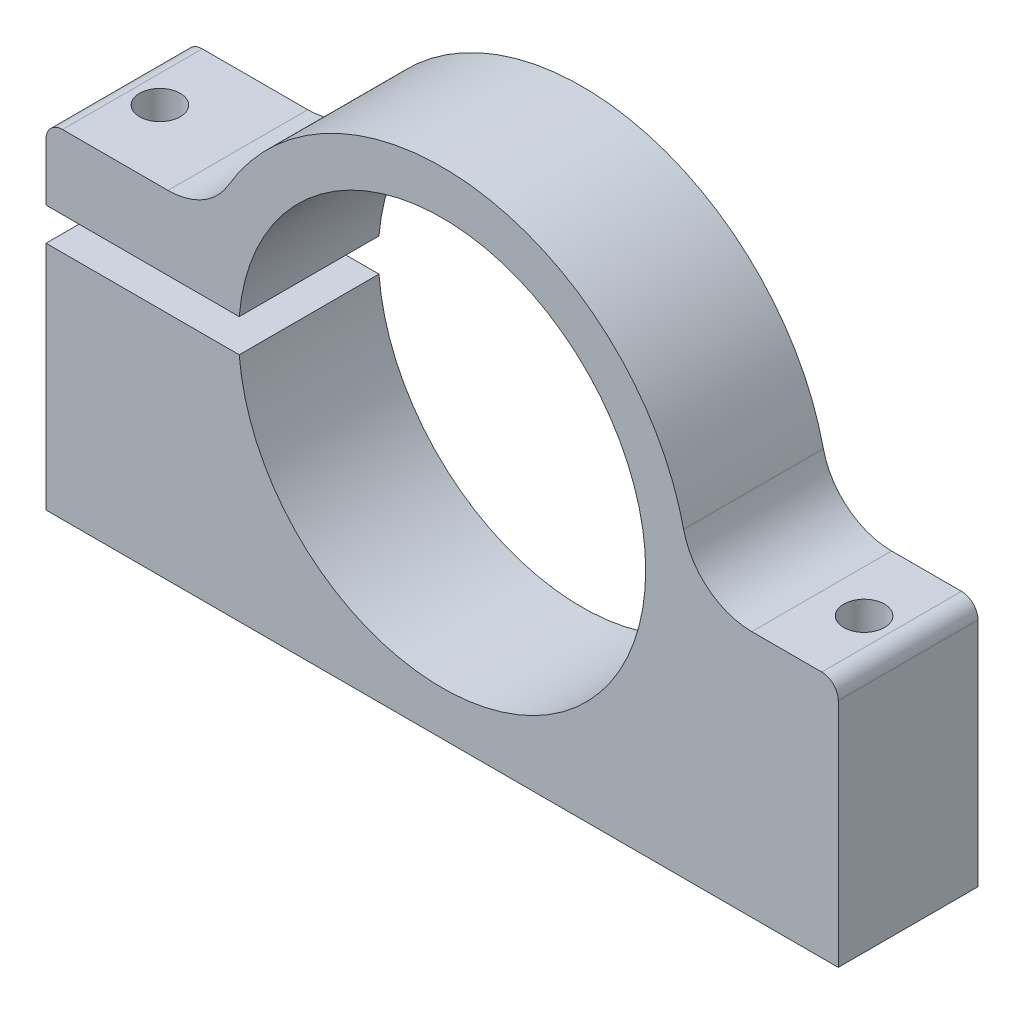
ISO-10303-21;
HEADER;
FILE_DESCRIPTION(('STEP AP214'),'2;1');
FILE_NAME('part.step','',(''),(''),'','','');
FILE_SCHEMA(('AUTOMOTIVE_DESIGN { 1 0 10303 214 1 1 1 1 }'));
ENDSEC;
DATA;
#1=APPLICATION_CONTEXT('core data for automotive mechanical design processes');
#2=APPLICATION_PROTOCOL_DEFINITION('international standard','automotive_design',2000,#1);
#3=PRODUCT_CONTEXT('',#1,'mechanical');
#4=PRODUCT('Part','Part','',(#3));
#5=PRODUCT_RELATED_PRODUCT_CATEGORY('part','',(#4));
#6=PRODUCT_DEFINITION_FORMATION('','',#4);
#7=PRODUCT_DEFINITION_CONTEXT('part definition',#1,'design');
#8=PRODUCT_DEFINITION('design','',#6,#7);
#9=PRODUCT_DEFINITION_SHAPE('','',#8);
#10=(LENGTH_UNIT() NAMED_UNIT(*) SI_UNIT(.MILLI.,.METRE.));
#11=(NAMED_UNIT(*) PLANE_ANGLE_UNIT() SI_UNIT($,.RADIAN.));
#12=(NAMED_UNIT(*) SI_UNIT($,.STERADIAN.) SOLID_ANGLE_UNIT());
#13=UNCERTAINTY_MEASURE_WITH_UNIT(LENGTH_MEASURE(1.E-05),#10,'distance_accuracy_value','');
#14=(GEOMETRIC_REPRESENTATION_CONTEXT(3) GLOBAL_UNCERTAINTY_ASSIGNED_CONTEXT((#13)) GLOBAL_UNIT_ASSIGNED_CONTEXT((#10,
#11,#12)) REPRESENTATION_CONTEXT('',''));
#15=CARTESIAN_POINT('',(0.,0.,0.));
#16=DIRECTION('',(0.,0.,1.));
#17=DIRECTION('',(1.,0.,0.));
#18=AXIS2_PLACEMENT_3D('',#15,#16,#17);
#19=CARTESIAN_POINT('',(32.,0.,0.));
#20=DIRECTION('',(0.,-1.,0.));
#21=DIRECTION('',(0.,0.,-1.));
#22=AXIS2_PLACEMENT_3D('',#19,#20,#21);
#23=CYLINDRICAL_SURFACE('',#22,1.85);
#24=CARTESIAN_POINT('',(32.,0.,0.));
#25=DIRECTION('',(0.,-1.,0.));
#26=DIRECTION('',(0.,0.,-1.));
#27=AXIS2_PLACEMENT_3D('',#24,#25,#26);
#28=CIRCLE('',#27,1.85);
#29=CARTESIAN_POINT('',(32.,0.,-1.85));
#30=VERTEX_POINT('',#29);
#31=EDGE_CURVE('E18',#30,#30,#28,.T.);
#32=ORIENTED_EDGE('',*,*,#31,.F.);
#33=EDGE_LOOP('',(#32));
#34=FACE_BOUND('',#33,.T.);
#35=CARTESIAN_POINT('',(32.,-22.5,0.));
#36=DIRECTION('',(0.,-1.,0.));
#37=DIRECTION('',(0.,0.,-1.));
#38=AXIS2_PLACEMENT_3D('',#35,#36,#37);
#39=CIRCLE('',#38,1.85);
#40=CARTESIAN_POINT('',(32.,-22.5,-1.85));
#41=VERTEX_POINT('',#40);
#42=EDGE_CURVE('E134',#41,#41,#39,.F.);
#43=ORIENTED_EDGE('',*,*,#42,.F.);
#44=EDGE_LOOP('',(#43));
#45=FACE_BOUND('',#44,.T.);
#46=ADVANCED_FACE('F15',(#34,#45),#23,.F.);
#47=CARTESIAN_POINT('',(-32.,8.2,0.));
#48=DIRECTION('',(0.,-1.,0.));
#49=DIRECTION('',(0.,0.,-1.));
#50=AXIS2_PLACEMENT_3D('',#47,#48,#49);
#51=CYLINDRICAL_SURFACE('',#50,1.85);
#52=CARTESIAN_POINT('',(-32.,-1.5,0.));
#53=DIRECTION('',(0.,-1.,0.));
#54=DIRECTION('',(0.,0.,-1.));
#55=AXIS2_PLACEMENT_3D('',#52,#53,#54);
#56=CIRCLE('',#55,1.85);
#57=CARTESIAN_POINT('',(-32.,-1.5,-1.85));
#58=VERTEX_POINT('',#57);
#59=EDGE_CURVE('E166',#58,#58,#56,.F.);
#60=ORIENTED_EDGE('',*,*,#59,.T.);
#61=EDGE_LOOP('',(#60));
#62=FACE_BOUND('',#61,.T.);
#63=CARTESIAN_POINT('',(-32.,-22.5,0.));
#64=DIRECTION('',(0.,-1.,0.));
#65=DIRECTION('',(0.,0.,-1.));
#66=AXIS2_PLACEMENT_3D('',#63,#64,#65);
#67=CIRCLE('',#66,1.85);
#68=CARTESIAN_POINT('',(-32.,-22.5,-1.85));
#69=VERTEX_POINT('',#68);
#70=EDGE_CURVE('E131',#69,#69,#67,.F.);
#71=ORIENTED_EDGE('',*,*,#70,.F.);
#72=EDGE_LOOP('',(#71));
#73=FACE_BOUND('',#72,.T.);
#74=ADVANCED_FACE('F374',(#62,#73),#51,.F.);
#75=CARTESIAN_POINT('',(34.5,-1.5,22.90572));
#76=DIRECTION('',(0.,0.,-1.));
#77=DIRECTION('',(-1.,0.,0.));
#78=AXIS2_PLACEMENT_3D('',#75,#76,#77);
#79=CYLINDRICAL_SURFACE('',#78,1.5);
#80=DIRECTION('',(0.,0.,-1.));
#81=VECTOR('',#80,1.);
#82=CARTESIAN_POINT('',(36.,-1.5,-6.35));
#83=LINE('',#82,#81);
#84=CARTESIAN_POINT('',(36.,-1.5,-6.35));
#85=VERTEX_POINT('',#84);
#86=CARTESIAN_POINT('',(36.,-1.5,6.35));
#87=VERTEX_POINT('',#86);
#88=EDGE_CURVE('E170',#85,#87,#83,.F.);
#89=ORIENTED_EDGE('',*,*,#88,.F.);
#90=CARTESIAN_POINT('',(34.5,-1.5,-6.35));
#91=DIRECTION('',(0.,0.,-1.));
#92=DIRECTION('',(-1.,0.,0.));
#93=AXIS2_PLACEMENT_3D('',#90,#91,#92);
#94=CIRCLE('',#93,1.5);
#95=CARTESIAN_POINT('',(34.5,0.,-6.35));
#96=VERTEX_POINT('',#95);
#97=EDGE_CURVE('E211',#85,#96,#94,.F.);
#98=ORIENTED_EDGE('',*,*,#97,.T.);
#99=DIRECTION('',(0.,0.,1.));
#100=VECTOR('',#99,1.);
#101=CARTESIAN_POINT('',(34.5,0.,-6.35));
#102=LINE('',#101,#100);
#103=CARTESIAN_POINT('',(34.5,0.,6.35));
#104=VERTEX_POINT('',#103);
#105=EDGE_CURVE('E175',#104,#96,#102,.F.);
#106=ORIENTED_EDGE('',*,*,#105,.F.);
#107=CARTESIAN_POINT('',(34.5,-1.5,6.35));
#108=DIRECTION('',(0.,0.,-1.));
#109=DIRECTION('',(-1.,0.,0.));
#110=AXIS2_PLACEMENT_3D('',#107,#108,#109);
#111=CIRCLE('',#110,1.5);
#112=EDGE_CURVE('E216',#87,#104,#111,.F.);
#113=ORIENTED_EDGE('',*,*,#112,.F.);
#114=EDGE_LOOP('',(#89,#98,#106,#113));
#115=FACE_BOUND('',#114,.T.);
#116=ADVANCED_FACE('F279',(#115),#79,.T.);
#117=CARTESIAN_POINT('',(36.,0.,-6.35));
#118=DIRECTION('',(0.,1.,0.));
#119=DIRECTION('',(0.,0.,1.));
#120=AXIS2_PLACEMENT_3D('',#117,#118,#119);
#121=PLANE('',#120);
#122=ORIENTED_EDGE('',*,*,#31,.T.);
#123=EDGE_LOOP('',(#122));
#124=FACE_BOUND('',#123,.T.);
#125=DIRECTION('',(1.,0.,0.));
#126=VECTOR('',#125,1.);
#127=CARTESIAN_POINT('',(0.,0.,6.35));
#128=LINE('',#127,#126);
#129=CARTESIAN_POINT('',(28.1424945589406,0.,6.35));
#130=VERTEX_POINT('',#129);
#131=EDGE_CURVE('E96',#104,#130,#128,.F.);
#132=ORIENTED_EDGE('',*,*,#131,.F.);
#133=ORIENTED_EDGE('',*,*,#105,.T.);
#134=DIRECTION('',(1.,0.,0.));
#135=VECTOR('',#134,1.);
#136=CARTESIAN_POINT('',(0.,0.,-6.35));
#137=LINE('',#136,#135);
#138=CARTESIAN_POINT('',(28.1424945589406,0.,-6.35));
#139=VERTEX_POINT('',#138);
#140=EDGE_CURVE('E210',#96,#139,#137,.F.);
#141=ORIENTED_EDGE('',*,*,#140,.T.);
#142=DIRECTION('',(0.,0.,1.));
#143=VECTOR('',#142,1.);
#144=CARTESIAN_POINT('',(28.1424945589406,0.,-22.90572));
#145=LINE('',#144,#143);
#146=EDGE_CURVE('E117',#139,#130,#145,.T.);
#147=ORIENTED_EDGE('',*,*,#146,.T.);
#148=EDGE_LOOP('',(#132,#133,#141,#147));
#149=FACE_BOUND('',#148,.T.);
#150=ADVANCED_FACE('F282',(#124,#149),#121,.T.);
#151=CARTESIAN_POINT('',(28.1424945589406,6.35,-22.90572));
#152=DIRECTION('',(0.,0.,1.));
#153=DIRECTION('',(1.,0.,0.));
#154=AXIS2_PLACEMENT_3D('',#151,#152,#153);
#155=CYLINDRICAL_SURFACE('',#154,6.35);
#156=ORIENTED_EDGE('',*,*,#146,.F.);
#157=CARTESIAN_POINT('',(28.1424945589406,6.35,-6.35));
#158=DIRECTION('',(0.,0.,1.));
#159=DIRECTION('',(1.,0.,0.));
#160=AXIS2_PLACEMENT_3D('',#157,#158,#159);
#161=CIRCLE('',#160,6.35);
#162=CARTESIAN_POINT('',(21.9482193267301,4.95233968804159,-6.35));
#163=VERTEX_POINT('',#162);
#164=EDGE_CURVE('E112',#139,#163,#161,.F.);
#165=ORIENTED_EDGE('',*,*,#164,.T.);
#166=DIRECTION('',(0.,0.,1.));
#167=VECTOR('',#166,1.);
#168=CARTESIAN_POINT('',(21.9482193267301,4.95233968804159,-6.35));
#169=LINE('',#168,#167);
#170=CARTESIAN_POINT('',(21.9482193267301,4.95233968804159,6.35));
#171=VERTEX_POINT('',#170);
#172=EDGE_CURVE('E109',#171,#163,#169,.F.);
#173=ORIENTED_EDGE('',*,*,#172,.F.);
#174=CARTESIAN_POINT('',(28.1424945589406,6.35,6.35));
#175=DIRECTION('',(0.,0.,1.));
#176=DIRECTION('',(1.,0.,0.));
#177=AXIS2_PLACEMENT_3D('',#174,#175,#176);
#178=CIRCLE('',#177,6.35);
#179=EDGE_CURVE('E99',#130,#171,#178,.F.);
#180=ORIENTED_EDGE('',*,*,#179,.F.);
#181=EDGE_LOOP('',(#156,#165,#173,#180));
#182=FACE_BOUND('',#181,.T.);
#183=ADVANCED_FACE('F110',(#182),#155,.F.);
#184=CARTESIAN_POINT('',(0.,0.,-6.35));
#185=DIRECTION('',(0.,0.,1.));
#186=DIRECTION('',(1.,0.,0.));
#187=AXIS2_PLACEMENT_3D('',#184,#185,#186);
#188=CYLINDRICAL_SURFACE('',#187,22.5);
#189=CARTESIAN_POINT('',(0.,0.,6.35));
#190=DIRECTION('',(0.,0.,1.));
#191=DIRECTION('',(1.,0.,0.));
#192=AXIS2_PLACEMENT_3D('',#189,#190,#191);
#193=CIRCLE('',#192,22.5);
#194=CARTESIAN_POINT('',(-19.4289613398529,11.3474870017331,6.35));
#195=VERTEX_POINT('',#194);
#196=EDGE_CURVE('E104',#171,#195,#193,.T.);
#197=ORIENTED_EDGE('',*,*,#196,.F.);
#198=ORIENTED_EDGE('',*,*,#172,.T.);
#199=CARTESIAN_POINT('',(0.,0.,-6.35));
#200=DIRECTION('',(0.,0.,1.));
#201=DIRECTION('',(1.,0.,0.));
#202=AXIS2_PLACEMENT_3D('',#199,#200,#201);
#203=CIRCLE('',#202,22.5);
#204=CARTESIAN_POINT('',(-19.4289613398529,11.3474870017331,-6.35));
#205=VERTEX_POINT('',#204);
#206=EDGE_CURVE('E207',#163,#205,#203,.T.);
#207=ORIENTED_EDGE('',*,*,#206,.T.);
#208=DIRECTION('',(0.,0.,1.));
#209=VECTOR('',#208,1.);
#210=CARTESIAN_POINT('',(-19.4289613398529,11.3474870017331,-22.90572));
#211=LINE('',#210,#209);
#212=EDGE_CURVE('E116',#205,#195,#211,.T.);
#213=ORIENTED_EDGE('',*,*,#212,.T.);
#214=EDGE_LOOP('',(#197,#198,#207,#213));
#215=FACE_BOUND('',#214,.T.);
#216=ADVANCED_FACE('F119',(#215),#188,.T.);
#217=CARTESIAN_POINT('',(-24.9122459846558,14.55,-22.90572));
#218=DIRECTION('',(0.,0.,1.));
#219=DIRECTION('',(1.,0.,0.));
#220=AXIS2_PLACEMENT_3D('',#217,#218,#219);
#221=CYLINDRICAL_SURFACE('',#220,6.35);
#222=ORIENTED_EDGE('',*,*,#212,.F.);
#223=CARTESIAN_POINT('',(-24.9122459846558,14.55,-6.35));
#224=DIRECTION('',(0.,0.,1.));
#225=DIRECTION('',(1.,0.,0.));
#226=AXIS2_PLACEMENT_3D('',#223,#224,#225);
#227=CIRCLE('',#226,6.35);
#228=CARTESIAN_POINT('',(-24.9122459846558,8.2,-6.35));
#229=VERTEX_POINT('',#228);
#230=EDGE_CURVE('E204',#205,#229,#227,.F.);
#231=ORIENTED_EDGE('',*,*,#230,.T.);
#232=DIRECTION('',(0.,0.,1.));
#233=VECTOR('',#232,1.);
#234=CARTESIAN_POINT('',(-24.9122459846558,8.2,-6.35));
#235=LINE('',#234,#233);
#236=CARTESIAN_POINT('',(-24.9122459846558,8.2,6.35));
#237=VERTEX_POINT('',#236);
#238=EDGE_CURVE('E148',#237,#229,#235,.F.);
#239=ORIENTED_EDGE('',*,*,#238,.F.);
#240=CARTESIAN_POINT('',(-24.9122459846558,14.55,6.35));
#241=DIRECTION('',(0.,0.,1.));
#242=DIRECTION('',(1.,0.,0.));
#243=AXIS2_PLACEMENT_3D('',#240,#241,#242);
#244=CIRCLE('',#243,6.35);
#245=EDGE_CURVE('E121',#195,#237,#244,.F.);
#246=ORIENTED_EDGE('',*,*,#245,.F.);
#247=EDGE_LOOP('',(#222,#231,#239,#246));
#248=FACE_BOUND('',#247,.T.);
#249=ADVANCED_FACE('F290',(#248),#221,.F.);
#250=CARTESIAN_POINT('',(-20.9525654753779,8.2,-6.35));
#251=DIRECTION('',(0.,1.,0.));
#252=DIRECTION('',(0.,0.,1.));
#253=AXIS2_PLACEMENT_3D('',#250,#251,#252);
#254=PLANE('',#253);
#255=CARTESIAN_POINT('',(-32.,8.2,0.));
#256=DIRECTION('',(0.,-1.,0.));
#257=DIRECTION('',(0.,0.,-1.));
#258=AXIS2_PLACEMENT_3D('',#255,#256,#257);
#259=CIRCLE('',#258,1.85);
#260=CARTESIAN_POINT('',(-32.,8.2,-1.85));
#261=VERTEX_POINT('',#260);
#262=EDGE_CURVE('E127',#261,#261,#259,.T.);
#263=ORIENTED_EDGE('',*,*,#262,.T.);
#264=EDGE_LOOP('',(#263));
#265=FACE_BOUND('',#264,.T.);
#266=DIRECTION('',(1.,0.,0.));
#267=VECTOR('',#266,1.);
#268=CARTESIAN_POINT('',(0.,8.2,-6.35));
#269=LINE('',#268,#267);
#270=CARTESIAN_POINT('',(-34.5,8.2,-6.35));
#271=VERTEX_POINT('',#270);
#272=EDGE_CURVE('E203',#229,#271,#269,.F.);
#273=ORIENTED_EDGE('',*,*,#272,.T.);
#274=DIRECTION('',(0.,0.,-1.));
#275=VECTOR('',#274,1.);
#276=CARTESIAN_POINT('',(-34.5,8.2,22.90572));
#277=LINE('',#276,#275);
#278=CARTESIAN_POINT('',(-34.5,8.2,6.35));
#279=VERTEX_POINT('',#278);
#280=EDGE_CURVE('E140',#279,#271,#277,.T.);
#281=ORIENTED_EDGE('',*,*,#280,.F.);
#282=DIRECTION('',(1.,0.,0.));
#283=VECTOR('',#282,1.);
#284=CARTESIAN_POINT('',(0.,8.2,6.35));
#285=LINE('',#284,#283);
#286=EDGE_CURVE('E123',#237,#279,#285,.F.);
#287=ORIENTED_EDGE('',*,*,#286,.F.);
#288=ORIENTED_EDGE('',*,*,#238,.T.);
#289=EDGE_LOOP('',(#273,#281,#287,#288));
#290=FACE_BOUND('',#289,.T.);
#291=ADVANCED_FACE('F292',(#265,#290),#254,.T.);
#292=CARTESIAN_POINT('',(-34.5,6.7,22.90572));
#293=DIRECTION('',(0.,0.,-1.));
#294=DIRECTION('',(-1.,0.,0.));
#295=AXIS2_PLACEMENT_3D('',#292,#293,#294);
#296=CYLINDRICAL_SURFACE('',#295,1.5);
#297=ORIENTED_EDGE('',*,*,#280,.T.);
#298=CARTESIAN_POINT('',(-34.5,6.7,-6.35));
#299=DIRECTION('',(0.,0.,-1.));
#300=DIRECTION('',(-1.,0.,0.));
#301=AXIS2_PLACEMENT_3D('',#298,#299,#300);
#302=CIRCLE('',#301,1.5);
#303=CARTESIAN_POINT('',(-36.,6.7,-6.35));
#304=VERTEX_POINT('',#303);
#305=EDGE_CURVE('E199',#271,#304,#302,.F.);
#306=ORIENTED_EDGE('',*,*,#305,.T.);
#307=DIRECTION('',(0.,0.,1.));
#308=VECTOR('',#307,1.);
#309=CARTESIAN_POINT('',(-36.,6.7,-6.35));
#310=LINE('',#309,#308);
#311=CARTESIAN_POINT('',(-36.,6.7,6.35));
#312=VERTEX_POINT('',#311);
#313=EDGE_CURVE('E130',#312,#304,#310,.F.);
#314=ORIENTED_EDGE('',*,*,#313,.F.);
#315=CARTESIAN_POINT('',(-34.5,6.7,6.35));
#316=DIRECTION('',(0.,0.,-1.));
#317=DIRECTION('',(-1.,0.,0.));
#318=AXIS2_PLACEMENT_3D('',#315,#316,#317);
#319=CIRCLE('',#318,1.5);
#320=EDGE_CURVE('E217',#279,#312,#319,.F.);
#321=ORIENTED_EDGE('',*,*,#320,.F.);
#322=EDGE_LOOP('',(#297,#306,#314,#321));
#323=FACE_BOUND('',#322,.T.);
#324=ADVANCED_FACE('F294',(#323),#296,.T.);
#325=CARTESIAN_POINT('',(-36.,8.2,-6.35));
#326=DIRECTION('',(-1.,0.,0.));
#327=DIRECTION('',(0.,0.,1.));
#328=AXIS2_PLACEMENT_3D('',#325,#326,#327);
#329=PLANE('',#328);
#330=DIRECTION('',(0.,1.,0.));
#331=VECTOR('',#330,1.);
#332=CARTESIAN_POINT('',(-36.,0.,6.35));
#333=LINE('',#332,#331);
#334=CARTESIAN_POINT('',(-36.,-1.5,6.35));
#335=VERTEX_POINT('',#334);
#336=CARTESIAN_POINT('',(-36.,-22.5,6.35));
#337=VERTEX_POINT('',#336);
#338=EDGE_CURVE('E177',#335,#337,#333,.F.);
#339=ORIENTED_EDGE('',*,*,#338,.F.);
#340=DIRECTION('',(0.,0.,-1.));
#341=VECTOR('',#340,1.);
#342=CARTESIAN_POINT('',(-36.,-1.5,-7.62));
#343=LINE('',#342,#341);
#344=CARTESIAN_POINT('',(-36.,-1.5,-6.35));
#345=VERTEX_POINT('',#344);
#346=EDGE_CURVE('E163',#335,#345,#343,.T.);
#347=ORIENTED_EDGE('',*,*,#346,.T.);
#348=DIRECTION('',(0.,1.,0.));
#349=VECTOR('',#348,1.);
#350=CARTESIAN_POINT('',(-36.,0.,-6.35));
#351=LINE('',#350,#349);
#352=CARTESIAN_POINT('',(-36.,-22.5,-6.35));
#353=VERTEX_POINT('',#352);
#354=EDGE_CURVE('E156',#345,#353,#351,.F.);
#355=ORIENTED_EDGE('',*,*,#354,.T.);
#356=DIRECTION('',(0.,0.,-1.));
#357=VECTOR('',#356,1.);
#358=CARTESIAN_POINT('',(-36.,-22.5,-6.35));
#359=LINE('',#358,#357);
#360=EDGE_CURVE('E136',#337,#353,#359,.T.);
#361=ORIENTED_EDGE('',*,*,#360,.F.);
#362=EDGE_LOOP('',(#339,#347,#355,#361));
#363=FACE_BOUND('',#362,.T.);
#364=ADVANCED_FACE('F319',(#363),#329,.T.);
#365=CARTESIAN_POINT('',(-36.,-22.5,-6.35));
#366=DIRECTION('',(0.,-1.,0.));
#367=DIRECTION('',(0.,0.,-1.));
#368=AXIS2_PLACEMENT_3D('',#365,#366,#367);
#369=PLANE('',#368);
#370=ORIENTED_EDGE('',*,*,#70,.T.);
#371=EDGE_LOOP('',(#370));
#372=FACE_BOUND('',#371,.T.);
#373=ORIENTED_EDGE('',*,*,#42,.T.);
#374=EDGE_LOOP('',(#373));
#375=FACE_BOUND('',#374,.T.);
#376=ORIENTED_EDGE('',*,*,#360,.T.);
#377=DIRECTION('',(1.,0.,0.));
#378=VECTOR('',#377,1.);
#379=CARTESIAN_POINT('',(0.,-22.5,-6.35));
#380=LINE('',#379,#378);
#381=CARTESIAN_POINT('',(36.,-22.5,-6.35));
#382=VERTEX_POINT('',#381);
#383=EDGE_CURVE('E159',#353,#382,#380,.T.);
#384=ORIENTED_EDGE('',*,*,#383,.T.);
#385=DIRECTION('',(0.,0.,-1.));
#386=VECTOR('',#385,1.);
#387=CARTESIAN_POINT('',(36.,-22.5,-6.35));
#388=LINE('',#387,#386);
#389=CARTESIAN_POINT('',(36.,-22.5,6.35));
#390=VERTEX_POINT('',#389);
#391=EDGE_CURVE('E133',#390,#382,#388,.T.);
#392=ORIENTED_EDGE('',*,*,#391,.F.);
#393=DIRECTION('',(1.,0.,0.));
#394=VECTOR('',#393,1.);
#395=CARTESIAN_POINT('',(0.,-22.5,6.35));
#396=LINE('',#395,#394);
#397=EDGE_CURVE('E180',#337,#390,#396,.T.);
#398=ORIENTED_EDGE('',*,*,#397,.F.);
#399=EDGE_LOOP('',(#376,#384,#392,#398));
#400=FACE_BOUND('',#399,.T.);
#401=ADVANCED_FACE('F320',(#372,#375,#400),#369,.T.);
#402=CARTESIAN_POINT('',(36.,-22.5,-6.35));
#403=DIRECTION('',(1.,0.,0.));
#404=DIRECTION('',(0.,0.,-1.));
#405=AXIS2_PLACEMENT_3D('',#402,#403,#404);
#406=PLANE('',#405);
#407=DIRECTION('',(0.,1.,0.));
#408=VECTOR('',#407,1.);
#409=CARTESIAN_POINT('',(36.,0.,-6.35));
#410=LINE('',#409,#408);
#411=EDGE_CURVE('E242',#382,#85,#410,.T.);
#412=ORIENTED_EDGE('',*,*,#411,.T.);
#413=ORIENTED_EDGE('',*,*,#88,.T.);
#414=DIRECTION('',(0.,1.,0.));
#415=VECTOR('',#414,1.);
#416=CARTESIAN_POINT('',(36.,0.,6.35));
#417=LINE('',#416,#415);
#418=EDGE_CURVE('E186',#390,#87,#417,.T.);
#419=ORIENTED_EDGE('',*,*,#418,.F.);
#420=ORIENTED_EDGE('',*,*,#391,.T.);
#421=EDGE_LOOP('',(#412,#413,#419,#420));
#422=FACE_BOUND('',#421,.T.);
#423=ADVANCED_FACE('F321',(#422),#406,.T.);
#424=CARTESIAN_POINT('',(-36.,8.2,-6.35));
#425=DIRECTION('',(-1.,0.,0.));
#426=DIRECTION('',(0.,0.,1.));
#427=AXIS2_PLACEMENT_3D('',#424,#425,#426);
#428=PLANE('',#427);
#429=DIRECTION('',(0.,1.,0.));
#430=VECTOR('',#429,1.);
#431=CARTESIAN_POINT('',(-36.,0.,6.35));
#432=LINE('',#431,#430);
#433=CARTESIAN_POINT('',(-36.,1.5,6.35));
#434=VERTEX_POINT('',#433);
#435=EDGE_CURVE('E181',#312,#434,#432,.F.);
#436=ORIENTED_EDGE('',*,*,#435,.F.);
#437=ORIENTED_EDGE('',*,*,#313,.T.);
#438=DIRECTION('',(0.,1.,0.));
#439=VECTOR('',#438,1.);
#440=CARTESIAN_POINT('',(-36.,0.,-6.35));
#441=LINE('',#440,#439);
#442=CARTESIAN_POINT('',(-36.,1.5,-6.35));
#443=VERTEX_POINT('',#442);
#444=EDGE_CURVE('E202',#304,#443,#441,.F.);
#445=ORIENTED_EDGE('',*,*,#444,.T.);
#446=DIRECTION('',(0.,0.,1.));
#447=VECTOR('',#446,1.);
#448=CARTESIAN_POINT('',(-36.,1.5,-7.62));
#449=LINE('',#448,#447);
#450=EDGE_CURVE('E231',#443,#434,#449,.T.);
#451=ORIENTED_EDGE('',*,*,#450,.T.);
#452=EDGE_LOOP('',(#436,#437,#445,#451));
#453=FACE_BOUND('',#452,.T.);
#454=ADVANCED_FACE('F298',(#453),#428,.T.);
#455=CARTESIAN_POINT('',(-32.,8.2,0.));
#456=DIRECTION('',(0.,-1.,0.));
#457=DIRECTION('',(0.,0.,-1.));
#458=AXIS2_PLACEMENT_3D('',#455,#456,#457);
#459=CYLINDRICAL_SURFACE('',#458,1.85);
#460=CARTESIAN_POINT('',(-32.,1.49999999999999,0.));
#461=DIRECTION('',(0.,-1.,0.));
#462=DIRECTION('',(0.,0.,-1.));
#463=AXIS2_PLACEMENT_3D('',#460,#461,#462);
#464=CIRCLE('',#463,1.85);
#465=CARTESIAN_POINT('',(-32.,1.49999999999999,-1.85));
#466=VERTEX_POINT('',#465);
#467=EDGE_CURVE('E195',#466,#466,#464,.T.);
#468=ORIENTED_EDGE('',*,*,#467,.T.);
#469=EDGE_LOOP('',(#468));
#470=FACE_BOUND('',#469,.T.);
#471=ORIENTED_EDGE('',*,*,#262,.F.);
#472=EDGE_LOOP('',(#471));
#473=FACE_BOUND('',#472,.T.);
#474=ADVANCED_FACE('F329',(#470,#473),#459,.F.);
#475=CARTESIAN_POINT('',(0.,0.,6.35));
#476=DIRECTION('',(0.,0.,1.));
#477=DIRECTION('',(1.,0.,0.));
#478=AXIS2_PLACEMENT_3D('',#475,#476,#477);
#479=PLANE('',#478);
#480=ORIENTED_EDGE('',*,*,#418,.T.);
#481=ORIENTED_EDGE('',*,*,#112,.T.);
#482=ORIENTED_EDGE('',*,*,#131,.T.);
#483=ORIENTED_EDGE('',*,*,#179,.T.);
#484=ORIENTED_EDGE('',*,*,#196,.T.);
#485=ORIENTED_EDGE('',*,*,#245,.T.);
#486=ORIENTED_EDGE('',*,*,#286,.T.);
#487=ORIENTED_EDGE('',*,*,#320,.T.);
#488=ORIENTED_EDGE('',*,*,#435,.T.);
#489=DIRECTION('',(1.,0.,0.));
#490=VECTOR('',#489,1.);
#491=CARTESIAN_POINT('',(0.,1.5,6.35));
#492=LINE('',#491,#490);
#493=CARTESIAN_POINT('',(-18.4390889145858,1.5,6.35));
#494=VERTEX_POINT('',#493);
#495=EDGE_CURVE('E198',#434,#494,#492,.T.);
#496=ORIENTED_EDGE('',*,*,#495,.T.);
#497=CARTESIAN_POINT('',(0.,0.,6.35));
#498=DIRECTION('',(0.,0.,1.));
#499=DIRECTION('',(1.,0.,0.));
#500=AXIS2_PLACEMENT_3D('',#497,#498,#499);
#501=CIRCLE('',#500,18.5);
#502=CARTESIAN_POINT('',(-18.4390889145858,-1.5,6.35));
#503=VERTEX_POINT('',#502);
#504=EDGE_CURVE('E192',#494,#503,#501,.F.);
#505=ORIENTED_EDGE('',*,*,#504,.T.);
#506=DIRECTION('',(1.,0.,0.));
#507=VECTOR('',#506,1.);
#508=CARTESIAN_POINT('',(-36.,-1.5,6.35));
#509=LINE('',#508,#507);
#510=EDGE_CURVE('E167',#503,#335,#509,.F.);
#511=ORIENTED_EDGE('',*,*,#510,.T.);
#512=ORIENTED_EDGE('',*,*,#338,.T.);
#513=ORIENTED_EDGE('',*,*,#397,.T.);
#514=EDGE_LOOP('',(#480,#481,#482,#483,#484,#485,#486,#487,#488,#496,#505,#511,#512,#513));
#515=FACE_BOUND('',#514,.T.);
#516=ADVANCED_FACE('F102',(#515),#479,.T.);
#517=CARTESIAN_POINT('',(-36.,-1.5,-7.62));
#518=DIRECTION('',(0.,-1.,0.));
#519=DIRECTION('',(0.,0.,-1.));
#520=AXIS2_PLACEMENT_3D('',#517,#518,#519);
#521=PLANE('',#520);
#522=ORIENTED_EDGE('',*,*,#59,.F.);
#523=EDGE_LOOP('',(#522));
#524=FACE_BOUND('',#523,.T.);
#525=ORIENTED_EDGE('',*,*,#510,.F.);
#526=DIRECTION('',(0.,0.,1.));
#527=VECTOR('',#526,1.);
#528=CARTESIAN_POINT('',(-18.4390889145858,-1.5,-7.62));
#529=LINE('',#528,#527);
#530=CARTESIAN_POINT('',(-18.4390889145858,-1.5,-6.35));
#531=VERTEX_POINT('',#530);
#532=EDGE_CURVE('E191',#503,#531,#529,.F.);
#533=ORIENTED_EDGE('',*,*,#532,.T.);
#534=DIRECTION('',(1.,0.,0.));
#535=VECTOR('',#534,1.);
#536=CARTESIAN_POINT('',(0.,-1.5,-6.35));
#537=LINE('',#536,#535);
#538=EDGE_CURVE('E160',#531,#345,#537,.F.);
#539=ORIENTED_EDGE('',*,*,#538,.T.);
#540=ORIENTED_EDGE('',*,*,#346,.F.);
#541=EDGE_LOOP('',(#525,#533,#539,#540));
#542=FACE_BOUND('',#541,.T.);
#543=ADVANCED_FACE('F310',(#524,#542),#521,.F.);
#544=CARTESIAN_POINT('',(0.,0.,-6.35));
#545=DIRECTION('',(0.,0.,1.));
#546=DIRECTION('',(1.,0.,0.));
#547=AXIS2_PLACEMENT_3D('',#544,#545,#546);
#548=PLANE('',#547);
#549=ORIENTED_EDGE('',*,*,#383,.F.);
#550=ORIENTED_EDGE('',*,*,#354,.F.);
#551=ORIENTED_EDGE('',*,*,#538,.F.);
#552=CARTESIAN_POINT('',(0.,0.,-6.35));
#553=DIRECTION('',(0.,0.,1.));
#554=DIRECTION('',(1.,0.,0.));
#555=AXIS2_PLACEMENT_3D('',#552,#553,#554);
#556=CIRCLE('',#555,18.5);
#557=CARTESIAN_POINT('',(-18.4390889145858,1.5,-6.35));
#558=VERTEX_POINT('',#557);
#559=EDGE_CURVE('E24',#531,#558,#556,.T.);
#560=ORIENTED_EDGE('',*,*,#559,.T.);
#561=DIRECTION('',(1.,0.,0.));
#562=VECTOR('',#561,1.);
#563=CARTESIAN_POINT('',(0.,1.5,-6.35));
#564=LINE('',#563,#562);
#565=EDGE_CURVE('E32',#558,#443,#564,.F.);
#566=ORIENTED_EDGE('',*,*,#565,.T.);
#567=ORIENTED_EDGE('',*,*,#444,.F.);
#568=ORIENTED_EDGE('',*,*,#305,.F.);
#569=ORIENTED_EDGE('',*,*,#272,.F.);
#570=ORIENTED_EDGE('',*,*,#230,.F.);
#571=ORIENTED_EDGE('',*,*,#206,.F.);
#572=ORIENTED_EDGE('',*,*,#164,.F.);
#573=ORIENTED_EDGE('',*,*,#140,.F.);
#574=ORIENTED_EDGE('',*,*,#97,.F.);
#575=ORIENTED_EDGE('',*,*,#411,.F.);
#576=EDGE_LOOP('',(#549,#550,#551,#560,#566,#567,#568,#569,#570,#571,#572,#573,#574,#575));
#577=FACE_BOUND('',#576,.T.);
#578=ADVANCED_FACE('F284',(#577),#548,.F.);
#579=CARTESIAN_POINT('',(0.,1.5,-7.62));
#580=DIRECTION('',(0.,1.,0.));
#581=DIRECTION('',(0.,0.,1.));
#582=AXIS2_PLACEMENT_3D('',#579,#580,#581);
#583=PLANE('',#582);
#584=ORIENTED_EDGE('',*,*,#467,.F.);
#585=EDGE_LOOP('',(#584));
#586=FACE_BOUND('',#585,.T.);
#587=ORIENTED_EDGE('',*,*,#495,.F.);
#588=ORIENTED_EDGE('',*,*,#450,.F.);
#589=ORIENTED_EDGE('',*,*,#565,.F.);
#590=DIRECTION('',(0.,0.,1.));
#591=VECTOR('',#590,1.);
#592=CARTESIAN_POINT('',(-18.4390889145858,1.5,-7.62));
#593=LINE('',#592,#591);
#594=EDGE_CURVE('E10',#558,#494,#593,.T.);
#595=ORIENTED_EDGE('',*,*,#594,.T.);
#596=EDGE_LOOP('',(#587,#588,#589,#595));
#597=FACE_BOUND('',#596,.T.);
#598=ADVANCED_FACE('F302',(#586,#597),#583,.F.);
#599=CARTESIAN_POINT('',(0.,0.,-7.62));
#600=DIRECTION('',(0.,0.,1.));
#601=DIRECTION('',(1.,0.,0.));
#602=AXIS2_PLACEMENT_3D('',#599,#600,#601);
#603=CYLINDRICAL_SURFACE('',#602,18.5);
#604=ORIENTED_EDGE('',*,*,#559,.F.);
#605=ORIENTED_EDGE('',*,*,#532,.F.);
#606=ORIENTED_EDGE('',*,*,#504,.F.);
#607=ORIENTED_EDGE('',*,*,#594,.F.);
#608=EDGE_LOOP('',(#604,#605,#606,#607));
#609=FACE_BOUND('',#608,.T.);
#610=ADVANCED_FACE('F305',(#609),#603,.F.);
#611=CLOSED_SHELL('',(#46,#74,#116,#150,#183,#216,#249,#291,#324,#364,#401,#423,#454,#474,#516,
#543,#578,#598,#610));
#612=MANIFOLD_SOLID_BREP('B1',#611);
#613=ADVANCED_BREP_SHAPE_REPRESENTATION('',(#18,#612),#14);
#614=SHAPE_DEFINITION_REPRESENTATION(#9,#613);
ENDSEC;
END-ISO-10303-21;
